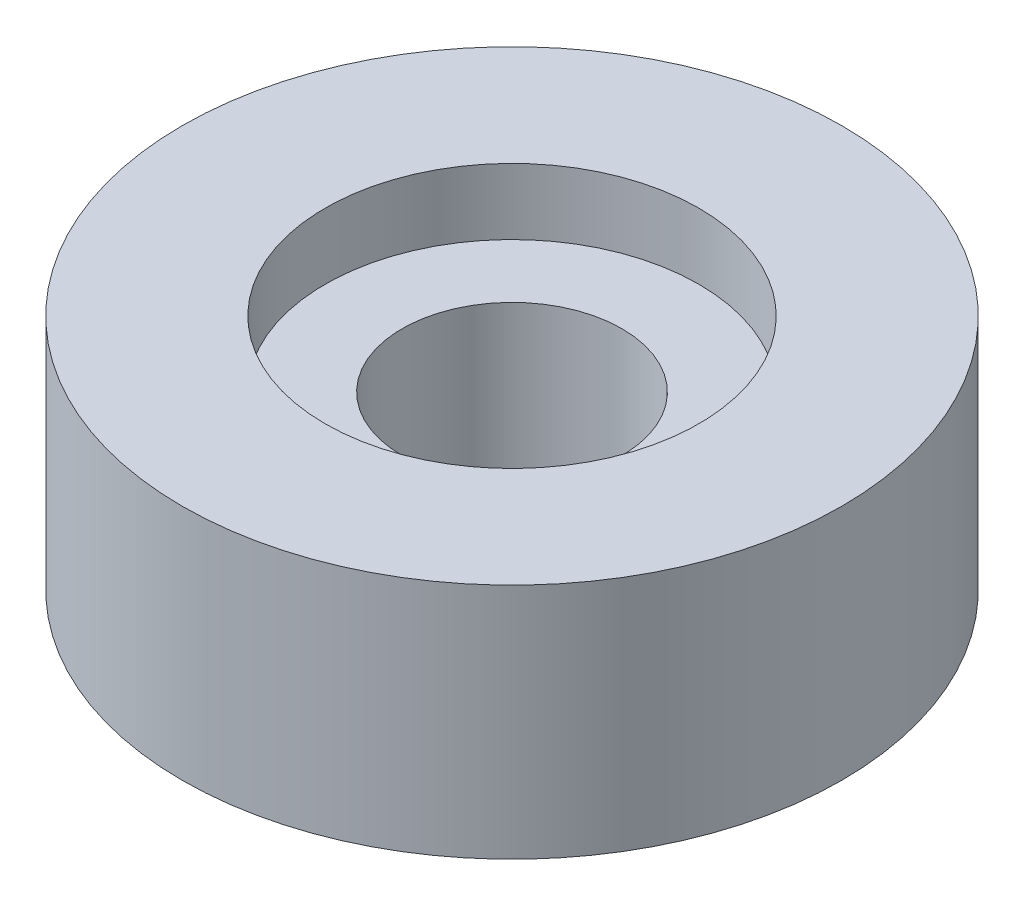
ISO-10303-21;
HEADER;
FILE_DESCRIPTION(('STEP AP214'),'2;1');
FILE_NAME('part.step','',(''),(''),'','','');
FILE_SCHEMA(('AUTOMOTIVE_DESIGN { 1 0 10303 214 1 1 1 1 }'));
ENDSEC;
DATA;
#1=APPLICATION_CONTEXT('core data for automotive mechanical design processes');
#2=APPLICATION_PROTOCOL_DEFINITION('international standard','automotive_design',2000,#1);
#3=PRODUCT_CONTEXT('',#1,'mechanical');
#4=PRODUCT('Part','Part','',(#3));
#5=PRODUCT_RELATED_PRODUCT_CATEGORY('part','',(#4));
#6=PRODUCT_DEFINITION_FORMATION('','',#4);
#7=PRODUCT_DEFINITION_CONTEXT('part definition',#1,'design');
#8=PRODUCT_DEFINITION('design','',#6,#7);
#9=PRODUCT_DEFINITION_SHAPE('','',#8);
#10=(LENGTH_UNIT() NAMED_UNIT(*) SI_UNIT(.MILLI.,.METRE.));
#11=(NAMED_UNIT(*) PLANE_ANGLE_UNIT() SI_UNIT($,.RADIAN.));
#12=(NAMED_UNIT(*) SI_UNIT($,.STERADIAN.) SOLID_ANGLE_UNIT());
#13=UNCERTAINTY_MEASURE_WITH_UNIT(LENGTH_MEASURE(1.E-05),#10,'distance_accuracy_value','');
#14=(GEOMETRIC_REPRESENTATION_CONTEXT(3) GLOBAL_UNCERTAINTY_ASSIGNED_CONTEXT((#13)) GLOBAL_UNIT_ASSIGNED_CONTEXT((#10,
#11,#12)) REPRESENTATION_CONTEXT('',''));
#15=CARTESIAN_POINT('',(0.,0.,0.));
#16=DIRECTION('',(0.,0.,1.));
#17=DIRECTION('',(1.,0.,0.));
#18=AXIS2_PLACEMENT_3D('',#15,#16,#17);
#19=CARTESIAN_POINT('',(0.,3.9,0.));
#20=DIRECTION('',(0.,1.,0.));
#21=DIRECTION('',(0.,0.,1.));
#22=AXIS2_PLACEMENT_3D('',#19,#20,#21);
#23=PLANE('',#22);
#24=CARTESIAN_POINT('',(0.,3.9,0.));
#25=DIRECTION('',(0.,1.,0.));
#26=DIRECTION('',(0.,0.,1.));
#27=AXIS2_PLACEMENT_3D('',#24,#25,#26);
#28=CIRCLE('',#27,2.5);
#29=CARTESIAN_POINT('',(0.,3.9,2.5));
#30=VERTEX_POINT('',#29);
#31=EDGE_CURVE('E42',#30,#30,#28,.T.);
#32=ORIENTED_EDGE('',*,*,#31,.F.);
#33=EDGE_LOOP('',(#32));
#34=FACE_BOUND('',#33,.T.);
#35=CARTESIAN_POINT('',(0.,3.9,0.));
#36=DIRECTION('',(0.,1.,0.));
#37=DIRECTION('',(0.,0.,1.));
#38=AXIS2_PLACEMENT_3D('',#35,#36,#37);
#39=CIRCLE('',#38,4.25);
#40=CARTESIAN_POINT('',(0.,3.9,4.25));
#41=VERTEX_POINT('',#40);
#42=EDGE_CURVE('E10',#41,#41,#39,.F.);
#43=ORIENTED_EDGE('',*,*,#42,.F.);
#44=EDGE_LOOP('',(#43));
#45=FACE_BOUND('',#44,.T.);
#46=ADVANCED_FACE('F31',(#34,#45),#23,.T.);
#47=CARTESIAN_POINT('',(0.,0.,0.));
#48=DIRECTION('',(0.,1.,0.));
#49=DIRECTION('',(0.,0.,1.));
#50=AXIS2_PLACEMENT_3D('',#47,#48,#49);
#51=PLANE('',#50);
#52=CARTESIAN_POINT('',(0.,0.,0.));
#53=DIRECTION('',(0.,1.,0.));
#54=DIRECTION('',(0.,0.,1.));
#55=AXIS2_PLACEMENT_3D('',#52,#53,#54);
#56=CIRCLE('',#55,7.5);
#57=CARTESIAN_POINT('',(0.,0.,7.5));
#58=VERTEX_POINT('',#57);
#59=EDGE_CURVE('E38',#58,#58,#56,.T.);
#60=ORIENTED_EDGE('',*,*,#59,.F.);
#61=EDGE_LOOP('',(#60));
#62=FACE_BOUND('',#61,.T.);
#63=CARTESIAN_POINT('',(0.,0.,0.));
#64=DIRECTION('',(0.,1.,0.));
#65=DIRECTION('',(0.,0.,1.));
#66=AXIS2_PLACEMENT_3D('',#63,#64,#65);
#67=CIRCLE('',#66,2.5);
#68=CARTESIAN_POINT('',(0.,0.,2.5));
#69=VERTEX_POINT('',#68);
#70=EDGE_CURVE('E46',#69,#69,#67,.T.);
#71=ORIENTED_EDGE('',*,*,#70,.T.);
#72=EDGE_LOOP('',(#71));
#73=FACE_BOUND('',#72,.T.);
#74=ADVANCED_FACE('F73',(#62,#73),#51,.F.);
#75=CARTESIAN_POINT('',(0.,3.9,0.));
#76=DIRECTION('',(0.,-1.,0.));
#77=DIRECTION('',(0.,0.,-1.));
#78=AXIS2_PLACEMENT_3D('',#75,#76,#77);
#79=CYLINDRICAL_SURFACE('',#78,7.5);
#80=ORIENTED_EDGE('',*,*,#59,.T.);
#81=EDGE_LOOP('',(#80));
#82=FACE_BOUND('',#81,.T.);
#83=CARTESIAN_POINT('',(0.,5.4,0.));
#84=DIRECTION('',(0.,1.,0.));
#85=DIRECTION('',(0.,0.,1.));
#86=AXIS2_PLACEMENT_3D('',#83,#84,#85);
#87=CIRCLE('',#86,7.5);
#88=CARTESIAN_POINT('',(0.,5.4,7.5));
#89=VERTEX_POINT('',#88);
#90=EDGE_CURVE('E50',#89,#89,#87,.T.);
#91=ORIENTED_EDGE('',*,*,#90,.F.);
#92=EDGE_LOOP('',(#91));
#93=FACE_BOUND('',#92,.T.);
#94=ADVANCED_FACE('F33',(#82,#93),#79,.T.);
#95=CARTESIAN_POINT('',(0.,3.9,0.));
#96=DIRECTION('',(0.,-1.,0.));
#97=DIRECTION('',(0.,0.,-1.));
#98=AXIS2_PLACEMENT_3D('',#95,#96,#97);
#99=CYLINDRICAL_SURFACE('',#98,2.5);
#100=ORIENTED_EDGE('',*,*,#31,.T.);
#101=EDGE_LOOP('',(#100));
#102=FACE_BOUND('',#101,.T.);
#103=ORIENTED_EDGE('',*,*,#70,.F.);
#104=EDGE_LOOP('',(#103));
#105=FACE_BOUND('',#104,.T.);
#106=ADVANCED_FACE('F62',(#102,#105),#99,.F.);
#107=CARTESIAN_POINT('',(0.,5.4,0.));
#108=DIRECTION('',(0.,1.,0.));
#109=DIRECTION('',(0.,0.,1.));
#110=AXIS2_PLACEMENT_3D('',#107,#108,#109);
#111=PLANE('',#110);
#112=ORIENTED_EDGE('',*,*,#90,.T.);
#113=EDGE_LOOP('',(#112));
#114=FACE_BOUND('',#113,.T.);
#115=CARTESIAN_POINT('',(0.,5.4,0.));
#116=DIRECTION('',(0.,1.,0.));
#117=DIRECTION('',(0.,0.,1.));
#118=AXIS2_PLACEMENT_3D('',#115,#116,#117);
#119=CIRCLE('',#118,4.25);
#120=CARTESIAN_POINT('',(0.,5.4,4.25));
#121=VERTEX_POINT('',#120);
#122=EDGE_CURVE('E54',#121,#121,#119,.T.);
#123=ORIENTED_EDGE('',*,*,#122,.F.);
#124=EDGE_LOOP('',(#123));
#125=FACE_BOUND('',#124,.T.);
#126=ADVANCED_FACE('F60',(#114,#125),#111,.T.);
#127=CARTESIAN_POINT('',(0.,5.4,0.));
#128=DIRECTION('',(0.,-1.,0.));
#129=DIRECTION('',(0.,0.,-1.));
#130=AXIS2_PLACEMENT_3D('',#127,#128,#129);
#131=CYLINDRICAL_SURFACE('',#130,4.25);
#132=ORIENTED_EDGE('',*,*,#122,.T.);
#133=EDGE_LOOP('',(#132));
#134=FACE_BOUND('',#133,.T.);
#135=ORIENTED_EDGE('',*,*,#42,.T.);
#136=EDGE_LOOP('',(#135));
#137=FACE_BOUND('',#136,.T.);
#138=ADVANCED_FACE('F58',(#134,#137),#131,.F.);
#139=CLOSED_SHELL('',(#46,#74,#94,#106,#126,#138));
#140=MANIFOLD_SOLID_BREP('B2',#139);
#141=ADVANCED_BREP_SHAPE_REPRESENTATION('',(#18,#140),#14);
#142=SHAPE_DEFINITION_REPRESENTATION(#9,#141);
ENDSEC;
END-ISO-10303-21;
